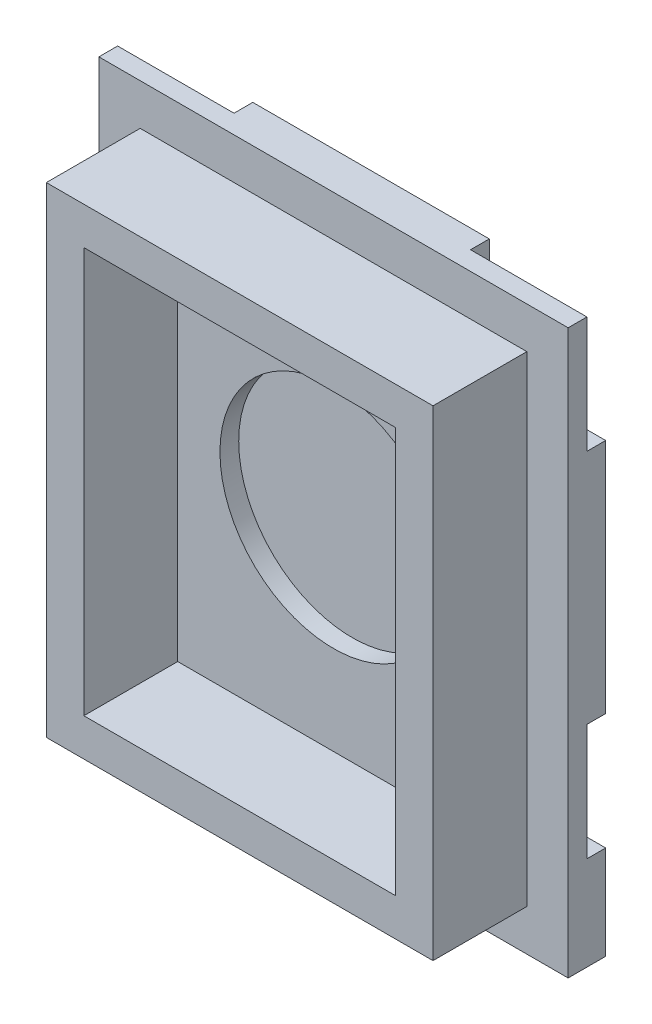
ISO-10303-21;
HEADER;
FILE_DESCRIPTION(('STEP AP214'),'2;1');
FILE_NAME('part.step','',(''),(''),'','','');
FILE_SCHEMA(('AUTOMOTIVE_DESIGN { 1 0 10303 214 1 1 1 1 }'));
ENDSEC;
DATA;
#1=APPLICATION_CONTEXT('core data for automotive mechanical design processes');
#2=APPLICATION_PROTOCOL_DEFINITION('international standard','automotive_design',2000,#1);
#3=PRODUCT_CONTEXT('',#1,'mechanical');
#4=PRODUCT('Part','Part','',(#3));
#5=PRODUCT_RELATED_PRODUCT_CATEGORY('part','',(#4));
#6=PRODUCT_DEFINITION_FORMATION('','',#4);
#7=PRODUCT_DEFINITION_CONTEXT('part definition',#1,'design');
#8=PRODUCT_DEFINITION('design','',#6,#7);
#9=PRODUCT_DEFINITION_SHAPE('','',#8);
#10=(LENGTH_UNIT() NAMED_UNIT(*) SI_UNIT(.MILLI.,.METRE.));
#11=(NAMED_UNIT(*) PLANE_ANGLE_UNIT() SI_UNIT($,.RADIAN.));
#12=(NAMED_UNIT(*) SI_UNIT($,.STERADIAN.) SOLID_ANGLE_UNIT());
#13=UNCERTAINTY_MEASURE_WITH_UNIT(LENGTH_MEASURE(1.E-05),#10,'distance_accuracy_value','');
#14=(GEOMETRIC_REPRESENTATION_CONTEXT(3) GLOBAL_UNCERTAINTY_ASSIGNED_CONTEXT((#13)) GLOBAL_UNIT_ASSIGNED_CONTEXT((#10,
#11,#12)) REPRESENTATION_CONTEXT('',''));
#15=CARTESIAN_POINT('',(0.,0.,0.));
#16=DIRECTION('',(0.,0.,1.));
#17=DIRECTION('',(1.,0.,0.));
#18=AXIS2_PLACEMENT_3D('',#15,#16,#17);
#19=CARTESIAN_POINT('',(0.,0.,2.));
#20=DIRECTION('',(0.,0.,1.));
#21=DIRECTION('',(1.,0.,0.));
#22=AXIS2_PLACEMENT_3D('',#19,#20,#21);
#23=PLANE('',#22);
#24=DIRECTION('',(0.,-1.,0.));
#25=VECTOR('',#24,1.);
#26=CARTESIAN_POINT('',(-36.7372745805237,39.7071428571429,2.));
#27=LINE('',#26,#25);
#28=CARTESIAN_POINT('',(-36.7372745805237,39.7071428571429,2.));
#29=VERTEX_POINT('',#28);
#30=CARTESIAN_POINT('',(-36.7372745805237,9.70714285714287,2.));
#31=VERTEX_POINT('',#30);
#32=EDGE_CURVE('E234',#29,#31,#27,.T.);
#33=ORIENTED_EDGE('',*,*,#32,.T.);
#34=DIRECTION('',(1.,0.,0.));
#35=VECTOR('',#34,1.);
#36=CARTESIAN_POINT('',(-36.7372745805237,9.70714285714287,2.));
#37=LINE('',#36,#35);
#38=CARTESIAN_POINT('',(-11.7372745805237,9.70714285714287,2.));
#39=VERTEX_POINT('',#38);
#40=EDGE_CURVE('E272',#31,#39,#37,.T.);
#41=ORIENTED_EDGE('',*,*,#40,.T.);
#42=DIRECTION('',(0.,1.,0.));
#43=VECTOR('',#42,1.);
#44=CARTESIAN_POINT('',(-11.7372745805237,39.7071428571429,2.));
#45=LINE('',#44,#43);
#46=CARTESIAN_POINT('',(-11.7372745805237,39.7071428571429,2.));
#47=VERTEX_POINT('',#46);
#48=EDGE_CURVE('E240',#39,#47,#45,.T.);
#49=ORIENTED_EDGE('',*,*,#48,.T.);
#50=DIRECTION('',(-1.,0.,0.));
#51=VECTOR('',#50,1.);
#52=CARTESIAN_POINT('',(-36.7372745805237,39.7071428571429,2.));
#53=LINE('',#52,#51);
#54=EDGE_CURVE('E236',#47,#29,#53,.T.);
#55=ORIENTED_EDGE('',*,*,#54,.T.);
#56=EDGE_LOOP('',(#33,#41,#49,#55));
#57=FACE_BOUND('',#56,.T.);
#58=DIRECTION('',(-1.,0.,0.));
#59=VECTOR('',#58,1.);
#60=CARTESIAN_POINT('',(-13.9372745805237,37.5071428571429,2.));
#61=LINE('',#60,#59);
#62=CARTESIAN_POINT('',(-13.9372745805237,37.5071428571429,2.));
#63=VERTEX_POINT('',#62);
#64=CARTESIAN_POINT('',(-34.5372745805237,37.5071428571429,2.));
#65=VERTEX_POINT('',#64);
#66=EDGE_CURVE('E291',#63,#65,#61,.T.);
#67=ORIENTED_EDGE('',*,*,#66,.F.);
#68=DIRECTION('',(0.,1.,0.));
#69=VECTOR('',#68,1.);
#70=CARTESIAN_POINT('',(-13.9372745805237,37.5071428571429,2.));
#71=LINE('',#70,#69);
#72=CARTESIAN_POINT('',(-13.9372745805237,11.9071428571429,2.));
#73=VERTEX_POINT('',#72);
#74=EDGE_CURVE('E293',#73,#63,#71,.T.);
#75=ORIENTED_EDGE('',*,*,#74,.F.);
#76=DIRECTION('',(1.,0.,0.));
#77=VECTOR('',#76,1.);
#78=CARTESIAN_POINT('',(-13.9372745805237,11.9071428571429,2.));
#79=LINE('',#78,#77);
#80=CARTESIAN_POINT('',(-34.5372745805237,11.9071428571429,2.));
#81=VERTEX_POINT('',#80);
#82=EDGE_CURVE('E285',#81,#73,#79,.T.);
#83=ORIENTED_EDGE('',*,*,#82,.F.);
#84=DIRECTION('',(0.,-1.,0.));
#85=VECTOR('',#84,1.);
#86=CARTESIAN_POINT('',(-34.5372745805237,37.5071428571429,2.));
#87=LINE('',#86,#85);
#88=EDGE_CURVE('E288',#65,#81,#87,.T.);
#89=ORIENTED_EDGE('',*,*,#88,.F.);
#90=EDGE_LOOP('',(#67,#75,#83,#89));
#91=FACE_BOUND('',#90,.T.);
#92=ADVANCED_FACE('F33',(#57,#91),#23,.T.);
#93=CARTESIAN_POINT('',(-36.7372745805237,39.7071428571429,2.));
#94=DIRECTION('',(1.,0.,0.));
#95=DIRECTION('',(0.,1.,0.));
#96=AXIS2_PLACEMENT_3D('',#93,#94,#95);
#97=PLANE('',#96);
#98=DIRECTION('',(0.,1.,0.));
#99=VECTOR('',#98,1.);
#100=CARTESIAN_POINT('',(-36.7372745805237,39.7071428571429,1.));
#101=LINE('',#100,#99);
#102=CARTESIAN_POINT('',(-36.7372745805237,33.5071428571429,1.));
#103=VERTEX_POINT('',#102);
#104=CARTESIAN_POINT('',(-36.7372745805237,39.7071428571429,1.));
#105=VERTEX_POINT('',#104);
#106=EDGE_CURVE('E209',#103,#105,#101,.T.);
#107=ORIENTED_EDGE('',*,*,#106,.F.);
#108=DIRECTION('',(0.,0.,-1.));
#109=VECTOR('',#108,1.);
#110=CARTESIAN_POINT('',(-36.7372745805237,33.5071428571429,1.));
#111=LINE('',#110,#109);
#112=CARTESIAN_POINT('',(-36.7372745805237,33.5071428571429,0.));
#113=VERTEX_POINT('',#112);
#114=EDGE_CURVE('E350',#103,#113,#111,.T.);
#115=ORIENTED_EDGE('',*,*,#114,.T.);
#116=DIRECTION('',(0.,-1.,0.));
#117=VECTOR('',#116,1.);
#118=CARTESIAN_POINT('',(-36.7372745805237,39.7071428571429,0.));
#119=LINE('',#118,#117);
#120=CARTESIAN_POINT('',(-36.7372745805237,20.9071428571429,0.));
#121=VERTEX_POINT('',#120);
#122=EDGE_CURVE('E267',#113,#121,#119,.T.);
#123=ORIENTED_EDGE('',*,*,#122,.T.);
#124=DIRECTION('',(0.,0.,-1.));
#125=VECTOR('',#124,1.);
#126=CARTESIAN_POINT('',(-36.7372745805237,20.9071428571429,1.));
#127=LINE('',#126,#125);
#128=CARTESIAN_POINT('',(-36.7372745805237,20.9071428571429,1.));
#129=VERTEX_POINT('',#128);
#130=EDGE_CURVE('E48',#129,#121,#127,.T.);
#131=ORIENTED_EDGE('',*,*,#130,.F.);
#132=DIRECTION('',(0.,1.,0.));
#133=VECTOR('',#132,1.);
#134=CARTESIAN_POINT('',(-36.7372745805237,14.7071428571429,1.));
#135=LINE('',#134,#133);
#136=CARTESIAN_POINT('',(-36.7372745805237,14.7071428571429,1.));
#137=VERTEX_POINT('',#136);
#138=EDGE_CURVE('E400',#137,#129,#135,.T.);
#139=ORIENTED_EDGE('',*,*,#138,.F.);
#140=DIRECTION('',(0.,0.,-1.));
#141=VECTOR('',#140,1.);
#142=CARTESIAN_POINT('',(-36.7372745805237,14.7071428571429,1.));
#143=LINE('',#142,#141);
#144=CARTESIAN_POINT('',(-36.7372745805237,14.7071428571429,0.));
#145=VERTEX_POINT('',#144);
#146=EDGE_CURVE('E394',#137,#145,#143,.T.);
#147=ORIENTED_EDGE('',*,*,#146,.T.);
#148=CARTESIAN_POINT('',(-36.7372745805237,9.70714285714287,0.));
#149=VERTEX_POINT('',#148);
#150=EDGE_CURVE('E268',#145,#149,#119,.T.);
#151=ORIENTED_EDGE('',*,*,#150,.T.);
#152=DIRECTION('',(0.,0.,-1.));
#153=VECTOR('',#152,1.);
#154=CARTESIAN_POINT('',(-36.7372745805237,9.70714285714287,2.));
#155=LINE('',#154,#153);
#156=EDGE_CURVE('E11',#31,#149,#155,.T.);
#157=ORIENTED_EDGE('',*,*,#156,.F.);
#158=ORIENTED_EDGE('',*,*,#32,.F.);
#159=DIRECTION('',(0.,0.,-1.));
#160=VECTOR('',#159,1.);
#161=CARTESIAN_POINT('',(-36.7372745805237,39.7071428571429,2.));
#162=LINE('',#161,#160);
#163=EDGE_CURVE('E227',#29,#105,#162,.T.);
#164=ORIENTED_EDGE('',*,*,#163,.T.);
#165=EDGE_LOOP('',(#107,#115,#123,#131,#139,#147,#151,#157,#158,#164));
#166=FACE_BOUND('',#165,.T.);
#167=ADVANCED_FACE('F35',(#166),#97,.F.);
#168=CARTESIAN_POINT('',(-36.7372745805237,9.70714285714287,2.));
#169=DIRECTION('',(0.,1.,0.));
#170=DIRECTION('',(0.,0.,1.));
#171=AXIS2_PLACEMENT_3D('',#168,#169,#170);
#172=PLANE('',#171);
#173=DIRECTION('',(1.,0.,0.));
#174=VECTOR('',#173,1.);
#175=CARTESIAN_POINT('',(-36.7372745805237,9.70714285714287,0.));
#176=LINE('',#175,#174);
#177=CARTESIAN_POINT('',(-11.7372745805237,9.70714285714287,0.));
#178=VERTEX_POINT('',#177);
#179=EDGE_CURVE('E261',#149,#178,#176,.T.);
#180=ORIENTED_EDGE('',*,*,#179,.T.);
#181=DIRECTION('',(0.,0.,-1.));
#182=VECTOR('',#181,1.);
#183=CARTESIAN_POINT('',(-11.7372745805237,9.70714285714287,2.));
#184=LINE('',#183,#182);
#185=EDGE_CURVE('E41',#39,#178,#184,.T.);
#186=ORIENTED_EDGE('',*,*,#185,.F.);
#187=ORIENTED_EDGE('',*,*,#40,.F.);
#188=ORIENTED_EDGE('',*,*,#156,.T.);
#189=EDGE_LOOP('',(#180,#186,#187,#188));
#190=FACE_BOUND('',#189,.T.);
#191=ADVANCED_FACE('F490',(#190),#172,.F.);
#192=CARTESIAN_POINT('',(-11.7372745805237,39.7071428571429,2.));
#193=DIRECTION('',(-1.,0.,0.));
#194=DIRECTION('',(0.,-1.,0.));
#195=AXIS2_PLACEMENT_3D('',#192,#193,#194);
#196=PLANE('',#195);
#197=DIRECTION('',(0.,-1.,0.));
#198=VECTOR('',#197,1.);
#199=CARTESIAN_POINT('',(-11.7372745805237,14.7071428571429,1.));
#200=LINE('',#199,#198);
#201=CARTESIAN_POINT('',(-11.7372745805237,20.9071428571429,1.));
#202=VERTEX_POINT('',#201);
#203=CARTESIAN_POINT('',(-11.7372745805237,14.7071428571429,1.));
#204=VERTEX_POINT('',#203);
#205=EDGE_CURVE('E372',#202,#204,#200,.T.);
#206=ORIENTED_EDGE('',*,*,#205,.F.);
#207=DIRECTION('',(0.,0.,-1.));
#208=VECTOR('',#207,1.);
#209=CARTESIAN_POINT('',(-11.7372745805237,20.9071428571429,1.));
#210=LINE('',#209,#208);
#211=CARTESIAN_POINT('',(-11.7372745805237,20.9071428571429,0.));
#212=VERTEX_POINT('',#211);
#213=EDGE_CURVE('E366',#202,#212,#210,.T.);
#214=ORIENTED_EDGE('',*,*,#213,.T.);
#215=DIRECTION('',(0.,1.,0.));
#216=VECTOR('',#215,1.);
#217=CARTESIAN_POINT('',(-11.7372745805237,39.7071428571429,0.));
#218=LINE('',#217,#216);
#219=CARTESIAN_POINT('',(-11.7372745805237,33.5071428571429,0.));
#220=VERTEX_POINT('',#219);
#221=EDGE_CURVE('E264',#212,#220,#218,.T.);
#222=ORIENTED_EDGE('',*,*,#221,.T.);
#223=DIRECTION('',(0.,0.,-1.));
#224=VECTOR('',#223,1.);
#225=CARTESIAN_POINT('',(-11.7372745805237,33.5071428571429,1.));
#226=LINE('',#225,#224);
#227=CARTESIAN_POINT('',(-11.7372745805237,33.5071428571429,1.));
#228=VERTEX_POINT('',#227);
#229=EDGE_CURVE('E336',#228,#220,#226,.T.);
#230=ORIENTED_EDGE('',*,*,#229,.F.);
#231=DIRECTION('',(0.,-1.,0.));
#232=VECTOR('',#231,1.);
#233=CARTESIAN_POINT('',(-11.7372745805237,39.7071428571429,1.));
#234=LINE('',#233,#232);
#235=CARTESIAN_POINT('',(-11.7372745805237,39.7071428571429,1.));
#236=VERTEX_POINT('',#235);
#237=EDGE_CURVE('E346',#236,#228,#234,.T.);
#238=ORIENTED_EDGE('',*,*,#237,.F.);
#239=DIRECTION('',(0.,0.,-1.));
#240=VECTOR('',#239,1.);
#241=CARTESIAN_POINT('',(-11.7372745805237,39.7071428571429,2.));
#242=LINE('',#241,#240);
#243=EDGE_CURVE('E235',#47,#236,#242,.T.);
#244=ORIENTED_EDGE('',*,*,#243,.F.);
#245=ORIENTED_EDGE('',*,*,#48,.F.);
#246=ORIENTED_EDGE('',*,*,#185,.T.);
#247=CARTESIAN_POINT('',(-11.7372745805237,14.7071428571429,0.));
#248=VERTEX_POINT('',#247);
#249=EDGE_CURVE('E253',#178,#248,#218,.T.);
#250=ORIENTED_EDGE('',*,*,#249,.T.);
#251=DIRECTION('',(0.,0.,-1.));
#252=VECTOR('',#251,1.);
#253=CARTESIAN_POINT('',(-11.7372745805237,14.7071428571429,1.));
#254=LINE('',#253,#252);
#255=EDGE_CURVE('E56',#204,#248,#254,.T.);
#256=ORIENTED_EDGE('',*,*,#255,.F.);
#257=EDGE_LOOP('',(#206,#214,#222,#230,#238,#244,#245,#246,#250,#256));
#258=FACE_BOUND('',#257,.T.);
#259=ADVANCED_FACE('F252',(#258),#196,.F.);
#260=CARTESIAN_POINT('',(-36.7372745805237,39.7071428571429,2.));
#261=DIRECTION('',(0.,-1.,0.));
#262=DIRECTION('',(0.,0.,-1.));
#263=AXIS2_PLACEMENT_3D('',#260,#261,#262);
#264=PLANE('',#263);
#265=DIRECTION('',(-1.,0.,0.));
#266=VECTOR('',#265,1.);
#267=CARTESIAN_POINT('',(-36.7372745805237,39.7071428571429,0.));
#268=LINE('',#267,#266);
#269=CARTESIAN_POINT('',(-17.9372745805237,39.7071428571429,0.));
#270=VERTEX_POINT('',#269);
#271=CARTESIAN_POINT('',(-30.5372745805237,39.7071428571429,0.));
#272=VERTEX_POINT('',#271);
#273=EDGE_CURVE('E243',#270,#272,#268,.T.);
#274=ORIENTED_EDGE('',*,*,#273,.T.);
#275=DIRECTION('',(0.,0.,-1.));
#276=VECTOR('',#275,1.);
#277=CARTESIAN_POINT('',(-30.5372745805237,39.7071428571429,1.));
#278=LINE('',#277,#276);
#279=CARTESIAN_POINT('',(-30.5372745805237,39.7071428571429,1.));
#280=VERTEX_POINT('',#279);
#281=EDGE_CURVE('E229',#280,#272,#278,.T.);
#282=ORIENTED_EDGE('',*,*,#281,.F.);
#283=DIRECTION('',(1.,0.,0.));
#284=VECTOR('',#283,1.);
#285=CARTESIAN_POINT('',(-36.7372745805237,39.7071428571429,1.));
#286=LINE('',#285,#284);
#287=EDGE_CURVE('E213',#105,#280,#286,.T.);
#288=ORIENTED_EDGE('',*,*,#287,.F.);
#289=ORIENTED_EDGE('',*,*,#163,.F.);
#290=ORIENTED_EDGE('',*,*,#54,.F.);
#291=ORIENTED_EDGE('',*,*,#243,.T.);
#292=DIRECTION('',(1.,0.,0.));
#293=VECTOR('',#292,1.);
#294=CARTESIAN_POINT('',(-11.7372745805237,39.7071428571429,1.));
#295=LINE('',#294,#293);
#296=CARTESIAN_POINT('',(-17.9372745805237,39.7071428571429,1.));
#297=VERTEX_POINT('',#296);
#298=EDGE_CURVE('E340',#297,#236,#295,.T.);
#299=ORIENTED_EDGE('',*,*,#298,.F.);
#300=DIRECTION('',(0.,0.,-1.));
#301=VECTOR('',#300,1.);
#302=CARTESIAN_POINT('',(-17.9372745805237,39.7071428571429,1.));
#303=LINE('',#302,#301);
#304=EDGE_CURVE('E325',#297,#270,#303,.T.);
#305=ORIENTED_EDGE('',*,*,#304,.T.);
#306=EDGE_LOOP('',(#274,#282,#288,#289,#290,#291,#299,#305));
#307=FACE_BOUND('',#306,.T.);
#308=ADVANCED_FACE('F225',(#307),#264,.F.);
#309=CARTESIAN_POINT('',(0.,0.,0.));
#310=DIRECTION('',(0.,0.,1.));
#311=DIRECTION('',(1.,0.,0.));
#312=AXIS2_PLACEMENT_3D('',#309,#310,#311);
#313=PLANE('',#312);
#314=ORIENTED_EDGE('',*,*,#122,.F.);
#315=DIRECTION('',(-1.,0.,0.));
#316=VECTOR('',#315,1.);
#317=CARTESIAN_POINT('',(-36.7372745805237,33.5071428571429,0.));
#318=LINE('',#317,#316);
#319=CARTESIAN_POINT('',(-30.5372745805237,33.5071428571429,0.));
#320=VERTEX_POINT('',#319);
#321=EDGE_CURVE('E220',#320,#113,#318,.T.);
#322=ORIENTED_EDGE('',*,*,#321,.F.);
#323=DIRECTION('',(0.,-1.,0.));
#324=VECTOR('',#323,1.);
#325=CARTESIAN_POINT('',(-30.5372745805237,39.7071428571429,0.));
#326=LINE('',#325,#324);
#327=EDGE_CURVE('E397',#272,#320,#326,.T.);
#328=ORIENTED_EDGE('',*,*,#327,.F.);
#329=ORIENTED_EDGE('',*,*,#273,.F.);
#330=DIRECTION('',(0.,1.,0.));
#331=VECTOR('',#330,1.);
#332=CARTESIAN_POINT('',(-17.9372745805237,39.7071428571429,0.));
#333=LINE('',#332,#331);
#334=CARTESIAN_POINT('',(-17.9372745805237,33.5071428571429,0.));
#335=VERTEX_POINT('',#334);
#336=EDGE_CURVE('E344',#335,#270,#333,.T.);
#337=ORIENTED_EDGE('',*,*,#336,.F.);
#338=DIRECTION('',(-1.,0.,0.));
#339=VECTOR('',#338,1.);
#340=CARTESIAN_POINT('',(-11.7372745805237,33.5071428571429,0.));
#341=LINE('',#340,#339);
#342=EDGE_CURVE('E347',#220,#335,#341,.T.);
#343=ORIENTED_EDGE('',*,*,#342,.F.);
#344=ORIENTED_EDGE('',*,*,#221,.F.);
#345=DIRECTION('',(1.,0.,0.));
#346=VECTOR('',#345,1.);
#347=CARTESIAN_POINT('',(-11.7372745805237,20.9071428571429,0.));
#348=LINE('',#347,#346);
#349=CARTESIAN_POINT('',(-17.9372745805237,20.9071428571429,0.));
#350=VERTEX_POINT('',#349);
#351=EDGE_CURVE('E370',#350,#212,#348,.T.);
#352=ORIENTED_EDGE('',*,*,#351,.F.);
#353=DIRECTION('',(0.,1.,0.));
#354=VECTOR('',#353,1.);
#355=CARTESIAN_POINT('',(-17.9372745805237,14.7071428571429,0.));
#356=LINE('',#355,#354);
#357=CARTESIAN_POINT('',(-17.9372745805237,14.7071428571429,0.));
#358=VERTEX_POINT('',#357);
#359=EDGE_CURVE('E373',#358,#350,#356,.T.);
#360=ORIENTED_EDGE('',*,*,#359,.F.);
#361=DIRECTION('',(-1.,0.,0.));
#362=VECTOR('',#361,1.);
#363=CARTESIAN_POINT('',(-11.7372745805237,14.7071428571429,0.));
#364=LINE('',#363,#362);
#365=EDGE_CURVE('E263',#248,#358,#364,.T.);
#366=ORIENTED_EDGE('',*,*,#365,.F.);
#367=ORIENTED_EDGE('',*,*,#249,.F.);
#368=ORIENTED_EDGE('',*,*,#179,.F.);
#369=ORIENTED_EDGE('',*,*,#150,.F.);
#370=DIRECTION('',(-1.,0.,0.));
#371=VECTOR('',#370,1.);
#372=CARTESIAN_POINT('',(-36.7372745805237,14.7071428571429,0.));
#373=LINE('',#372,#371);
#374=CARTESIAN_POINT('',(-30.5372745805237,14.7071428571429,0.));
#375=VERTEX_POINT('',#374);
#376=EDGE_CURVE('E398',#375,#145,#373,.T.);
#377=ORIENTED_EDGE('',*,*,#376,.F.);
#378=DIRECTION('',(0.,-1.,0.));
#379=VECTOR('',#378,1.);
#380=CARTESIAN_POINT('',(-30.5372745805237,14.7071428571429,0.));
#381=LINE('',#380,#379);
#382=CARTESIAN_POINT('',(-30.5372745805237,20.9071428571429,0.));
#383=VERTEX_POINT('',#382);
#384=EDGE_CURVE('E401',#383,#375,#381,.T.);
#385=ORIENTED_EDGE('',*,*,#384,.F.);
#386=DIRECTION('',(1.,0.,0.));
#387=VECTOR('',#386,1.);
#388=CARTESIAN_POINT('',(-36.7372745805237,20.9071428571429,0.));
#389=LINE('',#388,#387);
#390=EDGE_CURVE('E369',#121,#383,#389,.T.);
#391=ORIENTED_EDGE('',*,*,#390,.F.);
#392=EDGE_LOOP('',(#314,#322,#328,#329,#337,#343,#344,#352,#360,#366,#367,#368,#369,#377,#385,#391));
#393=FACE_BOUND('',#392,.T.);
#394=ADVANCED_FACE('F259',(#393),#313,.F.);
#395=CARTESIAN_POINT('',(-13.9372745805237,37.5071428571429,7.));
#396=DIRECTION('',(-1.,0.,0.));
#397=DIRECTION('',(0.,-1.,0.));
#398=AXIS2_PLACEMENT_3D('',#395,#396,#397);
#399=PLANE('',#398);
#400=ORIENTED_EDGE('',*,*,#74,.T.);
#401=DIRECTION('',(0.,0.,-1.));
#402=VECTOR('',#401,1.);
#403=CARTESIAN_POINT('',(-13.9372745805237,37.5071428571429,7.));
#404=LINE('',#403,#402);
#405=CARTESIAN_POINT('',(-13.9372745805237,37.5071428571429,7.));
#406=VERTEX_POINT('',#405);
#407=EDGE_CURVE('E269',#406,#63,#404,.T.);
#408=ORIENTED_EDGE('',*,*,#407,.F.);
#409=DIRECTION('',(0.,1.,0.));
#410=VECTOR('',#409,1.);
#411=CARTESIAN_POINT('',(-13.9372745805237,37.5071428571429,7.));
#412=LINE('',#411,#410);
#413=CARTESIAN_POINT('',(-13.9372745805237,11.9071428571429,7.));
#414=VERTEX_POINT('',#413);
#415=EDGE_CURVE('E287',#414,#406,#412,.T.);
#416=ORIENTED_EDGE('',*,*,#415,.F.);
#417=DIRECTION('',(0.,0.,-1.));
#418=VECTOR('',#417,1.);
#419=CARTESIAN_POINT('',(-13.9372745805237,11.9071428571429,7.));
#420=LINE('',#419,#418);
#421=EDGE_CURVE('E281',#414,#73,#420,.T.);
#422=ORIENTED_EDGE('',*,*,#421,.T.);
#423=EDGE_LOOP('',(#400,#408,#416,#422));
#424=FACE_BOUND('',#423,.T.);
#425=ADVANCED_FACE('F471',(#424),#399,.F.);
#426=CARTESIAN_POINT('',(-13.9372745805237,37.5071428571429,7.));
#427=DIRECTION('',(0.,-1.,0.));
#428=DIRECTION('',(0.,0.,-1.));
#429=AXIS2_PLACEMENT_3D('',#426,#427,#428);
#430=PLANE('',#429);
#431=ORIENTED_EDGE('',*,*,#66,.T.);
#432=DIRECTION('',(0.,0.,-1.));
#433=VECTOR('',#432,1.);
#434=CARTESIAN_POINT('',(-34.5372745805237,37.5071428571429,7.));
#435=LINE('',#434,#433);
#436=CARTESIAN_POINT('',(-34.5372745805237,37.5071428571429,7.));
#437=VERTEX_POINT('',#436);
#438=EDGE_CURVE('E276',#437,#65,#435,.T.);
#439=ORIENTED_EDGE('',*,*,#438,.F.);
#440=DIRECTION('',(-1.,0.,0.));
#441=VECTOR('',#440,1.);
#442=CARTESIAN_POINT('',(-13.9372745805237,37.5071428571429,7.));
#443=LINE('',#442,#441);
#444=EDGE_CURVE('E300',#406,#437,#443,.T.);
#445=ORIENTED_EDGE('',*,*,#444,.F.);
#446=ORIENTED_EDGE('',*,*,#407,.T.);
#447=EDGE_LOOP('',(#431,#439,#445,#446));
#448=FACE_BOUND('',#447,.T.);
#449=ADVANCED_FACE('F475',(#448),#430,.F.);
#450=CARTESIAN_POINT('',(-34.5372745805237,37.5071428571429,7.));
#451=DIRECTION('',(1.,0.,0.));
#452=DIRECTION('',(0.,0.,-1.));
#453=AXIS2_PLACEMENT_3D('',#450,#451,#452);
#454=PLANE('',#453);
#455=ORIENTED_EDGE('',*,*,#88,.T.);
#456=DIRECTION('',(0.,0.,-1.));
#457=VECTOR('',#456,1.);
#458=CARTESIAN_POINT('',(-34.5372745805237,11.9071428571429,7.));
#459=LINE('',#458,#457);
#460=CARTESIAN_POINT('',(-34.5372745805237,11.9071428571429,7.));
#461=VERTEX_POINT('',#460);
#462=EDGE_CURVE('E279',#461,#81,#459,.T.);
#463=ORIENTED_EDGE('',*,*,#462,.F.);
#464=DIRECTION('',(0.,-1.,0.));
#465=VECTOR('',#464,1.);
#466=CARTESIAN_POINT('',(-34.5372745805237,37.5071428571429,7.));
#467=LINE('',#466,#465);
#468=EDGE_CURVE('E298',#437,#461,#467,.T.);
#469=ORIENTED_EDGE('',*,*,#468,.F.);
#470=ORIENTED_EDGE('',*,*,#438,.T.);
#471=EDGE_LOOP('',(#455,#463,#469,#470));
#472=FACE_BOUND('',#471,.T.);
#473=ADVANCED_FACE('F480',(#472),#454,.F.);
#474=CARTESIAN_POINT('',(-13.9372745805237,11.9071428571429,7.));
#475=DIRECTION('',(0.,1.,0.));
#476=DIRECTION('',(-1.,0.,0.));
#477=AXIS2_PLACEMENT_3D('',#474,#475,#476);
#478=PLANE('',#477);
#479=ORIENTED_EDGE('',*,*,#82,.T.);
#480=ORIENTED_EDGE('',*,*,#421,.F.);
#481=DIRECTION('',(1.,0.,0.));
#482=VECTOR('',#481,1.);
#483=CARTESIAN_POINT('',(-13.9372745805237,11.9071428571429,7.));
#484=LINE('',#483,#482);
#485=EDGE_CURVE('E284',#461,#414,#484,.T.);
#486=ORIENTED_EDGE('',*,*,#485,.F.);
#487=ORIENTED_EDGE('',*,*,#462,.T.);
#488=EDGE_LOOP('',(#479,#480,#486,#487));
#489=FACE_BOUND('',#488,.T.);
#490=ADVANCED_FACE('F463',(#489),#478,.F.);
#491=CARTESIAN_POINT('',(0.,0.,7.));
#492=DIRECTION('',(0.,0.,-1.));
#493=DIRECTION('',(-1.,0.,0.));
#494=AXIS2_PLACEMENT_3D('',#491,#492,#493);
#495=PLANE('',#494);
#496=DIRECTION('',(1.,0.,0.));
#497=VECTOR('',#496,1.);
#498=CARTESIAN_POINT('',(-32.5372745805237,13.9071428571429,7.));
#499=LINE('',#498,#497);
#500=CARTESIAN_POINT('',(-32.5372745805237,13.9071428571429,7.));
#501=VERTEX_POINT('',#500);
#502=CARTESIAN_POINT('',(-15.9372745805237,13.9071428571429,7.));
#503=VERTEX_POINT('',#502);
#504=EDGE_CURVE('E320',#501,#503,#499,.T.);
#505=ORIENTED_EDGE('',*,*,#504,.F.);
#506=DIRECTION('',(0.,-1.,0.));
#507=VECTOR('',#506,1.);
#508=CARTESIAN_POINT('',(-32.5372745805237,13.9071428571429,7.));
#509=LINE('',#508,#507);
#510=CARTESIAN_POINT('',(-32.5372745805237,35.5071428571429,7.));
#511=VERTEX_POINT('',#510);
#512=EDGE_CURVE('E323',#511,#501,#509,.T.);
#513=ORIENTED_EDGE('',*,*,#512,.F.);
#514=DIRECTION('',(-1.,0.,0.));
#515=VECTOR('',#514,1.);
#516=CARTESIAN_POINT('',(-32.5372745805237,35.5071428571429,7.));
#517=LINE('',#516,#515);
#518=CARTESIAN_POINT('',(-15.9372745805237,35.5071428571429,7.));
#519=VERTEX_POINT('',#518);
#520=EDGE_CURVE('E313',#519,#511,#517,.T.);
#521=ORIENTED_EDGE('',*,*,#520,.F.);
#522=DIRECTION('',(0.,1.,0.));
#523=VECTOR('',#522,1.);
#524=CARTESIAN_POINT('',(-15.9372745805237,13.9071428571429,7.));
#525=LINE('',#524,#523);
#526=EDGE_CURVE('E317',#503,#519,#525,.T.);
#527=ORIENTED_EDGE('',*,*,#526,.F.);
#528=EDGE_LOOP('',(#505,#513,#521,#527));
#529=FACE_BOUND('',#528,.T.);
#530=ORIENTED_EDGE('',*,*,#415,.T.);
#531=ORIENTED_EDGE('',*,*,#444,.T.);
#532=ORIENTED_EDGE('',*,*,#468,.T.);
#533=ORIENTED_EDGE('',*,*,#485,.T.);
#534=EDGE_LOOP('',(#530,#531,#532,#533));
#535=FACE_BOUND('',#534,.T.);
#536=ADVANCED_FACE('F460',(#529,#535),#495,.F.);
#537=CARTESIAN_POINT('',(-32.5372745805237,13.9071428571429,2.));
#538=DIRECTION('',(-1.,0.,0.));
#539=DIRECTION('',(0.,0.,1.));
#540=AXIS2_PLACEMENT_3D('',#537,#538,#539);
#541=PLANE('',#540);
#542=ORIENTED_EDGE('',*,*,#512,.T.);
#543=DIRECTION('',(0.,0.,1.));
#544=VECTOR('',#543,1.);
#545=CARTESIAN_POINT('',(-32.5372745805237,13.9071428571429,2.));
#546=LINE('',#545,#544);
#547=CARTESIAN_POINT('',(-32.5372745805237,13.9071428571429,2.));
#548=VERTEX_POINT('',#547);
#549=EDGE_CURVE('E304',#548,#501,#546,.T.);
#550=ORIENTED_EDGE('',*,*,#549,.F.);
#551=DIRECTION('',(0.,-1.,0.));
#552=VECTOR('',#551,1.);
#553=CARTESIAN_POINT('',(-32.5372745805237,13.9071428571429,2.));
#554=LINE('',#553,#552);
#555=CARTESIAN_POINT('',(-32.5372745805237,35.5071428571429,2.));
#556=VERTEX_POINT('',#555);
#557=EDGE_CURVE('E316',#556,#548,#554,.T.);
#558=ORIENTED_EDGE('',*,*,#557,.F.);
#559=DIRECTION('',(0.,0.,1.));
#560=VECTOR('',#559,1.);
#561=CARTESIAN_POINT('',(-32.5372745805237,35.5071428571429,2.));
#562=LINE('',#561,#560);
#563=EDGE_CURVE('E296',#556,#511,#562,.T.);
#564=ORIENTED_EDGE('',*,*,#563,.T.);
#565=EDGE_LOOP('',(#542,#550,#558,#564));
#566=FACE_BOUND('',#565,.T.);
#567=ADVANCED_FACE('F448',(#566),#541,.F.);
#568=CARTESIAN_POINT('',(-32.5372745805237,35.5071428571429,2.));
#569=DIRECTION('',(0.,1.,0.));
#570=DIRECTION('',(0.,0.,1.));
#571=AXIS2_PLACEMENT_3D('',#568,#569,#570);
#572=PLANE('',#571);
#573=ORIENTED_EDGE('',*,*,#520,.T.);
#574=ORIENTED_EDGE('',*,*,#563,.F.);
#575=DIRECTION('',(-1.,0.,0.));
#576=VECTOR('',#575,1.);
#577=CARTESIAN_POINT('',(-32.5372745805237,35.5071428571429,2.));
#578=LINE('',#577,#576);
#579=CARTESIAN_POINT('',(-15.9372745805237,35.5071428571429,2.));
#580=VERTEX_POINT('',#579);
#581=EDGE_CURVE('E308',#580,#556,#578,.T.);
#582=ORIENTED_EDGE('',*,*,#581,.F.);
#583=DIRECTION('',(0.,0.,1.));
#584=VECTOR('',#583,1.);
#585=CARTESIAN_POINT('',(-15.9372745805237,35.5071428571429,2.));
#586=LINE('',#585,#584);
#587=EDGE_CURVE('E310',#580,#519,#586,.T.);
#588=ORIENTED_EDGE('',*,*,#587,.T.);
#589=EDGE_LOOP('',(#573,#574,#582,#588));
#590=FACE_BOUND('',#589,.T.);
#591=ADVANCED_FACE('F457',(#590),#572,.F.);
#592=CARTESIAN_POINT('',(-15.9372745805237,13.9071428571429,2.));
#593=DIRECTION('',(1.,0.,0.));
#594=DIRECTION('',(0.,0.,-1.));
#595=AXIS2_PLACEMENT_3D('',#592,#593,#594);
#596=PLANE('',#595);
#597=ORIENTED_EDGE('',*,*,#526,.T.);
#598=ORIENTED_EDGE('',*,*,#587,.F.);
#599=DIRECTION('',(0.,1.,0.));
#600=VECTOR('',#599,1.);
#601=CARTESIAN_POINT('',(-15.9372745805237,13.9071428571429,2.));
#602=LINE('',#601,#600);
#603=CARTESIAN_POINT('',(-15.9372745805237,13.9071428571429,2.));
#604=VERTEX_POINT('',#603);
#605=EDGE_CURVE('E328',#604,#580,#602,.T.);
#606=ORIENTED_EDGE('',*,*,#605,.F.);
#607=DIRECTION('',(0.,0.,1.));
#608=VECTOR('',#607,1.);
#609=CARTESIAN_POINT('',(-15.9372745805237,13.9071428571429,2.));
#610=LINE('',#609,#608);
#611=EDGE_CURVE('E307',#604,#503,#610,.T.);
#612=ORIENTED_EDGE('',*,*,#611,.T.);
#613=EDGE_LOOP('',(#597,#598,#606,#612));
#614=FACE_BOUND('',#613,.T.);
#615=ADVANCED_FACE('F455',(#614),#596,.F.);
#616=CARTESIAN_POINT('',(-32.5372745805237,13.9071428571429,2.));
#617=DIRECTION('',(0.,-1.,0.));
#618=DIRECTION('',(0.,0.,-1.));
#619=AXIS2_PLACEMENT_3D('',#616,#617,#618);
#620=PLANE('',#619);
#621=ORIENTED_EDGE('',*,*,#504,.T.);
#622=ORIENTED_EDGE('',*,*,#611,.F.);
#623=DIRECTION('',(1.,0.,0.));
#624=VECTOR('',#623,1.);
#625=CARTESIAN_POINT('',(-32.5372745805237,13.9071428571429,2.));
#626=LINE('',#625,#624);
#627=EDGE_CURVE('E331',#548,#604,#626,.T.);
#628=ORIENTED_EDGE('',*,*,#627,.F.);
#629=ORIENTED_EDGE('',*,*,#549,.T.);
#630=EDGE_LOOP('',(#621,#622,#628,#629));
#631=FACE_BOUND('',#630,.T.);
#632=ADVANCED_FACE('F442',(#631),#620,.F.);
#633=CARTESIAN_POINT('',(0.,0.,2.));
#634=DIRECTION('',(0.,0.,-1.));
#635=DIRECTION('',(-1.,0.,0.));
#636=AXIS2_PLACEMENT_3D('',#633,#634,#635);
#637=PLANE('',#636);
#638=CARTESIAN_POINT('',(-24.2372745805237,24.7071428571429,2.));
#639=DIRECTION('',(0.,0.,1.));
#640=DIRECTION('',(1.,0.,0.));
#641=AXIS2_PLACEMENT_3D('',#638,#639,#640);
#642=CIRCLE('',#641,6.05);
#643=CARTESIAN_POINT('',(-18.1872745805237,24.7071428571429,2.));
#644=VERTEX_POINT('',#643);
#645=EDGE_CURVE('E424',#644,#644,#642,.T.);
#646=ORIENTED_EDGE('',*,*,#645,.F.);
#647=EDGE_LOOP('',(#646));
#648=FACE_BOUND('',#647,.T.);
#649=ORIENTED_EDGE('',*,*,#557,.T.);
#650=ORIENTED_EDGE('',*,*,#627,.T.);
#651=ORIENTED_EDGE('',*,*,#605,.T.);
#652=ORIENTED_EDGE('',*,*,#581,.T.);
#653=EDGE_LOOP('',(#649,#650,#651,#652));
#654=FACE_BOUND('',#653,.T.);
#655=ADVANCED_FACE('F438',(#648,#654),#637,.F.);
#656=CARTESIAN_POINT('',(-17.9372745805237,39.7071428571429,1.));
#657=DIRECTION('',(-1.,0.,0.));
#658=DIRECTION('',(0.,0.,1.));
#659=AXIS2_PLACEMENT_3D('',#656,#657,#658);
#660=PLANE('',#659);
#661=ORIENTED_EDGE('',*,*,#336,.T.);
#662=ORIENTED_EDGE('',*,*,#304,.F.);
#663=DIRECTION('',(0.,1.,0.));
#664=VECTOR('',#663,1.);
#665=CARTESIAN_POINT('',(-17.9372745805237,39.7071428571429,1.));
#666=LINE('',#665,#664);
#667=CARTESIAN_POINT('',(-17.9372745805237,33.5071428571429,1.));
#668=VERTEX_POINT('',#667);
#669=EDGE_CURVE('E352',#668,#297,#666,.T.);
#670=ORIENTED_EDGE('',*,*,#669,.F.);
#671=DIRECTION('',(0.,0.,-1.));
#672=VECTOR('',#671,1.);
#673=CARTESIAN_POINT('',(-17.9372745805237,33.5071428571429,1.));
#674=LINE('',#673,#672);
#675=EDGE_CURVE('E339',#668,#335,#674,.T.);
#676=ORIENTED_EDGE('',*,*,#675,.T.);
#677=EDGE_LOOP('',(#661,#662,#670,#676));
#678=FACE_BOUND('',#677,.T.);
#679=ADVANCED_FACE('F441',(#678),#660,.F.);
#680=CARTESIAN_POINT('',(-11.7372745805237,33.5071428571429,1.));
#681=DIRECTION('',(0.,-1.,0.));
#682=DIRECTION('',(0.,0.,-1.));
#683=AXIS2_PLACEMENT_3D('',#680,#681,#682);
#684=PLANE('',#683);
#685=ORIENTED_EDGE('',*,*,#342,.T.);
#686=ORIENTED_EDGE('',*,*,#675,.F.);
#687=DIRECTION('',(-1.,0.,0.));
#688=VECTOR('',#687,1.);
#689=CARTESIAN_POINT('',(-11.7372745805237,33.5071428571429,1.));
#690=LINE('',#689,#688);
#691=EDGE_CURVE('E355',#228,#668,#690,.T.);
#692=ORIENTED_EDGE('',*,*,#691,.F.);
#693=ORIENTED_EDGE('',*,*,#229,.T.);
#694=EDGE_LOOP('',(#685,#686,#692,#693));
#695=FACE_BOUND('',#694,.T.);
#696=ADVANCED_FACE('F528',(#695),#684,.F.);
#697=CARTESIAN_POINT('',(0.,0.,1.));
#698=DIRECTION('',(0.,0.,-1.));
#699=DIRECTION('',(-1.,0.,0.));
#700=AXIS2_PLACEMENT_3D('',#697,#698,#699);
#701=PLANE('',#700);
#702=ORIENTED_EDGE('',*,*,#237,.T.);
#703=ORIENTED_EDGE('',*,*,#691,.T.);
#704=ORIENTED_EDGE('',*,*,#669,.T.);
#705=ORIENTED_EDGE('',*,*,#298,.T.);
#706=EDGE_LOOP('',(#702,#703,#704,#705));
#707=FACE_BOUND('',#706,.T.);
#708=ADVANCED_FACE('F524',(#707),#701,.T.);
#709=CARTESIAN_POINT('',(-11.7372745805237,20.9071428571429,1.));
#710=DIRECTION('',(0.,1.,0.));
#711=DIRECTION('',(0.,0.,1.));
#712=AXIS2_PLACEMENT_3D('',#709,#710,#711);
#713=PLANE('',#712);
#714=ORIENTED_EDGE('',*,*,#351,.T.);
#715=ORIENTED_EDGE('',*,*,#213,.F.);
#716=DIRECTION('',(1.,0.,0.));
#717=VECTOR('',#716,1.);
#718=CARTESIAN_POINT('',(-11.7372745805237,20.9071428571429,1.));
#719=LINE('',#718,#717);
#720=CARTESIAN_POINT('',(-17.9372745805237,20.9071428571429,1.));
#721=VERTEX_POINT('',#720);
#722=EDGE_CURVE('E362',#721,#202,#719,.T.);
#723=ORIENTED_EDGE('',*,*,#722,.F.);
#724=DIRECTION('',(0.,0.,-1.));
#725=VECTOR('',#724,1.);
#726=CARTESIAN_POINT('',(-17.9372745805237,20.9071428571429,1.));
#727=LINE('',#726,#725);
#728=EDGE_CURVE('E364',#721,#350,#727,.T.);
#729=ORIENTED_EDGE('',*,*,#728,.T.);
#730=EDGE_LOOP('',(#714,#715,#723,#729));
#731=FACE_BOUND('',#730,.T.);
#732=ADVANCED_FACE('F534',(#731),#713,.F.);
#733=CARTESIAN_POINT('',(-17.9372745805237,14.7071428571429,1.));
#734=DIRECTION('',(-1.,0.,0.));
#735=DIRECTION('',(0.,0.,1.));
#736=AXIS2_PLACEMENT_3D('',#733,#734,#735);
#737=PLANE('',#736);
#738=ORIENTED_EDGE('',*,*,#359,.T.);
#739=ORIENTED_EDGE('',*,*,#728,.F.);
#740=DIRECTION('',(0.,1.,0.));
#741=VECTOR('',#740,1.);
#742=CARTESIAN_POINT('',(-17.9372745805237,14.7071428571429,1.));
#743=LINE('',#742,#741);
#744=CARTESIAN_POINT('',(-17.9372745805237,14.7071428571429,1.));
#745=VERTEX_POINT('',#744);
#746=EDGE_CURVE('E380',#745,#721,#743,.T.);
#747=ORIENTED_EDGE('',*,*,#746,.F.);
#748=DIRECTION('',(0.,0.,-1.));
#749=VECTOR('',#748,1.);
#750=CARTESIAN_POINT('',(-17.9372745805237,14.7071428571429,1.));
#751=LINE('',#750,#749);
#752=EDGE_CURVE('E361',#745,#358,#751,.T.);
#753=ORIENTED_EDGE('',*,*,#752,.T.);
#754=EDGE_LOOP('',(#738,#739,#747,#753));
#755=FACE_BOUND('',#754,.T.);
#756=ADVANCED_FACE('F539',(#755),#737,.F.);
#757=CARTESIAN_POINT('',(-11.7372745805237,14.7071428571429,1.));
#758=DIRECTION('',(0.,-1.,0.));
#759=DIRECTION('',(0.,0.,-1.));
#760=AXIS2_PLACEMENT_3D('',#757,#758,#759);
#761=PLANE('',#760);
#762=ORIENTED_EDGE('',*,*,#365,.T.);
#763=ORIENTED_EDGE('',*,*,#752,.F.);
#764=DIRECTION('',(-1.,0.,0.));
#765=VECTOR('',#764,1.);
#766=CARTESIAN_POINT('',(-11.7372745805237,14.7071428571429,1.));
#767=LINE('',#766,#765);
#768=EDGE_CURVE('E383',#204,#745,#767,.T.);
#769=ORIENTED_EDGE('',*,*,#768,.F.);
#770=ORIENTED_EDGE('',*,*,#255,.T.);
#771=EDGE_LOOP('',(#762,#763,#769,#770));
#772=FACE_BOUND('',#771,.T.);
#773=ADVANCED_FACE('F540',(#772),#761,.F.);
#774=CARTESIAN_POINT('',(0.,0.,1.));
#775=DIRECTION('',(0.,0.,1.));
#776=DIRECTION('',(1.,0.,0.));
#777=AXIS2_PLACEMENT_3D('',#774,#775,#776);
#778=PLANE('',#777);
#779=ORIENTED_EDGE('',*,*,#205,.T.);
#780=ORIENTED_EDGE('',*,*,#768,.T.);
#781=ORIENTED_EDGE('',*,*,#746,.T.);
#782=ORIENTED_EDGE('',*,*,#722,.T.);
#783=EDGE_LOOP('',(#779,#780,#781,#782));
#784=FACE_BOUND('',#783,.T.);
#785=ADVANCED_FACE('F536',(#784),#778,.F.);
#786=CARTESIAN_POINT('',(-36.7372745805237,14.7071428571429,1.));
#787=DIRECTION('',(0.,-1.,0.));
#788=DIRECTION('',(1.,0.,0.));
#789=AXIS2_PLACEMENT_3D('',#786,#787,#788);
#790=PLANE('',#789);
#791=ORIENTED_EDGE('',*,*,#376,.T.);
#792=ORIENTED_EDGE('',*,*,#146,.F.);
#793=DIRECTION('',(-1.,0.,0.));
#794=VECTOR('',#793,1.);
#795=CARTESIAN_POINT('',(-36.7372745805237,14.7071428571429,1.));
#796=LINE('',#795,#794);
#797=CARTESIAN_POINT('',(-30.5372745805237,14.7071428571429,1.));
#798=VERTEX_POINT('',#797);
#799=EDGE_CURVE('E390',#798,#137,#796,.T.);
#800=ORIENTED_EDGE('',*,*,#799,.F.);
#801=DIRECTION('',(0.,0.,-1.));
#802=VECTOR('',#801,1.);
#803=CARTESIAN_POINT('',(-30.5372745805237,14.7071428571429,1.));
#804=LINE('',#803,#802);
#805=EDGE_CURVE('E392',#798,#375,#804,.T.);
#806=ORIENTED_EDGE('',*,*,#805,.T.);
#807=EDGE_LOOP('',(#791,#792,#800,#806));
#808=FACE_BOUND('',#807,.T.);
#809=ADVANCED_FACE('F506',(#808),#790,.F.);
#810=CARTESIAN_POINT('',(-30.5372745805237,14.7071428571429,1.));
#811=DIRECTION('',(1.,0.,0.));
#812=DIRECTION('',(0.,0.,-1.));
#813=AXIS2_PLACEMENT_3D('',#810,#811,#812);
#814=PLANE('',#813);
#815=ORIENTED_EDGE('',*,*,#384,.T.);
#816=ORIENTED_EDGE('',*,*,#805,.F.);
#817=DIRECTION('',(0.,-1.,0.));
#818=VECTOR('',#817,1.);
#819=CARTESIAN_POINT('',(-30.5372745805237,14.7071428571429,1.));
#820=LINE('',#819,#818);
#821=CARTESIAN_POINT('',(-30.5372745805237,20.9071428571429,1.));
#822=VERTEX_POINT('',#821);
#823=EDGE_CURVE('E407',#822,#798,#820,.T.);
#824=ORIENTED_EDGE('',*,*,#823,.F.);
#825=DIRECTION('',(0.,0.,-1.));
#826=VECTOR('',#825,1.);
#827=CARTESIAN_POINT('',(-30.5372745805237,20.9071428571429,1.));
#828=LINE('',#827,#826);
#829=EDGE_CURVE('E389',#822,#383,#828,.T.);
#830=ORIENTED_EDGE('',*,*,#829,.T.);
#831=EDGE_LOOP('',(#815,#816,#824,#830));
#832=FACE_BOUND('',#831,.T.);
#833=ADVANCED_FACE('F510',(#832),#814,.F.);
#834=CARTESIAN_POINT('',(-36.7372745805237,20.9071428571429,1.));
#835=DIRECTION('',(0.,1.,0.));
#836=DIRECTION('',(0.,0.,1.));
#837=AXIS2_PLACEMENT_3D('',#834,#835,#836);
#838=PLANE('',#837);
#839=ORIENTED_EDGE('',*,*,#390,.T.);
#840=ORIENTED_EDGE('',*,*,#829,.F.);
#841=DIRECTION('',(1.,0.,0.));
#842=VECTOR('',#841,1.);
#843=CARTESIAN_POINT('',(-36.7372745805237,20.9071428571429,1.));
#844=LINE('',#843,#842);
#845=EDGE_CURVE('E410',#129,#822,#844,.T.);
#846=ORIENTED_EDGE('',*,*,#845,.F.);
#847=ORIENTED_EDGE('',*,*,#130,.T.);
#848=EDGE_LOOP('',(#839,#840,#846,#847));
#849=FACE_BOUND('',#848,.T.);
#850=ADVANCED_FACE('F511',(#849),#838,.F.);
#851=CARTESIAN_POINT('',(0.,0.,1.));
#852=DIRECTION('',(0.,0.,-1.));
#853=DIRECTION('',(-1.,0.,0.));
#854=AXIS2_PLACEMENT_3D('',#851,#852,#853);
#855=PLANE('',#854);
#856=ORIENTED_EDGE('',*,*,#138,.T.);
#857=ORIENTED_EDGE('',*,*,#845,.T.);
#858=ORIENTED_EDGE('',*,*,#823,.T.);
#859=ORIENTED_EDGE('',*,*,#799,.T.);
#860=EDGE_LOOP('',(#856,#857,#858,#859));
#861=FACE_BOUND('',#860,.T.);
#862=ADVANCED_FACE('F716',(#861),#855,.T.);
#863=CARTESIAN_POINT('',(-36.7372745805237,33.5071428571429,1.));
#864=DIRECTION('',(0.,-1.,0.));
#865=DIRECTION('',(0.,0.,-1.));
#866=AXIS2_PLACEMENT_3D('',#863,#864,#865);
#867=PLANE('',#866);
#868=ORIENTED_EDGE('',*,*,#321,.T.);
#869=ORIENTED_EDGE('',*,*,#114,.F.);
#870=DIRECTION('',(-1.,0.,0.));
#871=VECTOR('',#870,1.);
#872=CARTESIAN_POINT('',(-36.7372745805237,33.5071428571429,1.));
#873=LINE('',#872,#871);
#874=CARTESIAN_POINT('',(-30.5372745805237,33.5071428571429,1.));
#875=VERTEX_POINT('',#874);
#876=EDGE_CURVE('E216',#875,#103,#873,.T.);
#877=ORIENTED_EDGE('',*,*,#876,.F.);
#878=DIRECTION('',(0.,0.,-1.));
#879=VECTOR('',#878,1.);
#880=CARTESIAN_POINT('',(-30.5372745805237,33.5071428571429,1.));
#881=LINE('',#880,#879);
#882=EDGE_CURVE('E416',#875,#320,#881,.T.);
#883=ORIENTED_EDGE('',*,*,#882,.T.);
#884=EDGE_LOOP('',(#868,#869,#877,#883));
#885=FACE_BOUND('',#884,.T.);
#886=ADVANCED_FACE('F515',(#885),#867,.F.);
#887=CARTESIAN_POINT('',(-30.5372745805237,39.7071428571429,1.));
#888=DIRECTION('',(1.,0.,0.));
#889=DIRECTION('',(0.,1.,0.));
#890=AXIS2_PLACEMENT_3D('',#887,#888,#889);
#891=PLANE('',#890);
#892=ORIENTED_EDGE('',*,*,#327,.T.);
#893=ORIENTED_EDGE('',*,*,#882,.F.);
#894=DIRECTION('',(0.,-1.,0.));
#895=VECTOR('',#894,1.);
#896=CARTESIAN_POINT('',(-30.5372745805237,39.7071428571429,1.));
#897=LINE('',#896,#895);
#898=EDGE_CURVE('E230',#280,#875,#897,.T.);
#899=ORIENTED_EDGE('',*,*,#898,.F.);
#900=ORIENTED_EDGE('',*,*,#281,.T.);
#901=EDGE_LOOP('',(#892,#893,#899,#900));
#902=FACE_BOUND('',#901,.T.);
#903=ADVANCED_FACE('F734',(#902),#891,.F.);
#904=CARTESIAN_POINT('',(0.,0.,1.));
#905=DIRECTION('',(0.,0.,1.));
#906=DIRECTION('',(1.,0.,0.));
#907=AXIS2_PLACEMENT_3D('',#904,#905,#906);
#908=PLANE('',#907);
#909=ORIENTED_EDGE('',*,*,#106,.T.);
#910=ORIENTED_EDGE('',*,*,#287,.T.);
#911=ORIENTED_EDGE('',*,*,#898,.T.);
#912=ORIENTED_EDGE('',*,*,#876,.T.);
#913=EDGE_LOOP('',(#909,#910,#911,#912));
#914=FACE_BOUND('',#913,.T.);
#915=ADVANCED_FACE('F211',(#914),#908,.F.);
#916=CARTESIAN_POINT('',(-24.2372745805237,24.7071428571429,1.));
#917=DIRECTION('',(0.,0.,1.));
#918=DIRECTION('',(1.,0.,0.));
#919=AXIS2_PLACEMENT_3D('',#916,#917,#918);
#920=CYLINDRICAL_SURFACE('',#919,6.05);
#921=CARTESIAN_POINT('',(-24.2372745805237,24.7071428571429,1.));
#922=DIRECTION('',(0.,0.,1.));
#923=DIRECTION('',(1.,0.,0.));
#924=AXIS2_PLACEMENT_3D('',#921,#922,#923);
#925=CIRCLE('',#924,6.05);
#926=CARTESIAN_POINT('',(-18.1872745805237,24.7071428571429,1.));
#927=VERTEX_POINT('',#926);
#928=EDGE_CURVE('E377',#927,#927,#925,.T.);
#929=ORIENTED_EDGE('',*,*,#928,.F.);
#930=EDGE_LOOP('',(#929));
#931=FACE_BOUND('',#930,.T.);
#932=ORIENTED_EDGE('',*,*,#645,.T.);
#933=EDGE_LOOP('',(#932));
#934=FACE_BOUND('',#933,.T.);
#935=ADVANCED_FACE('F432',(#931,#934),#920,.F.);
#936=CARTESIAN_POINT('',(-24.2372745805237,24.7071428571429,1.));
#937=DIRECTION('',(0.,0.,1.));
#938=DIRECTION('',(1.,0.,0.));
#939=AXIS2_PLACEMENT_3D('',#936,#937,#938);
#940=PLANE('',#939);
#941=ORIENTED_EDGE('',*,*,#928,.T.);
#942=EDGE_LOOP('',(#941));
#943=FACE_BOUND('',#942,.T.);
#944=ADVANCED_FACE('F430',(#943),#940,.T.);
#945=CLOSED_SHELL('',(#92,#167,#191,#259,#308,#394,#425,#449,#473,#490,#536,#567,#591,#615,#632,
#655,#679,#696,#708,#732,#756,#773,#785,#809,#833,#850,#862,#886,#903,#915,#935,#944));
#946=MANIFOLD_SOLID_BREP('B2',#945);
#947=ADVANCED_BREP_SHAPE_REPRESENTATION('',(#18,#946),#14);
#948=SHAPE_DEFINITION_REPRESENTATION(#9,#947);
ENDSEC;
END-ISO-10303-21;
